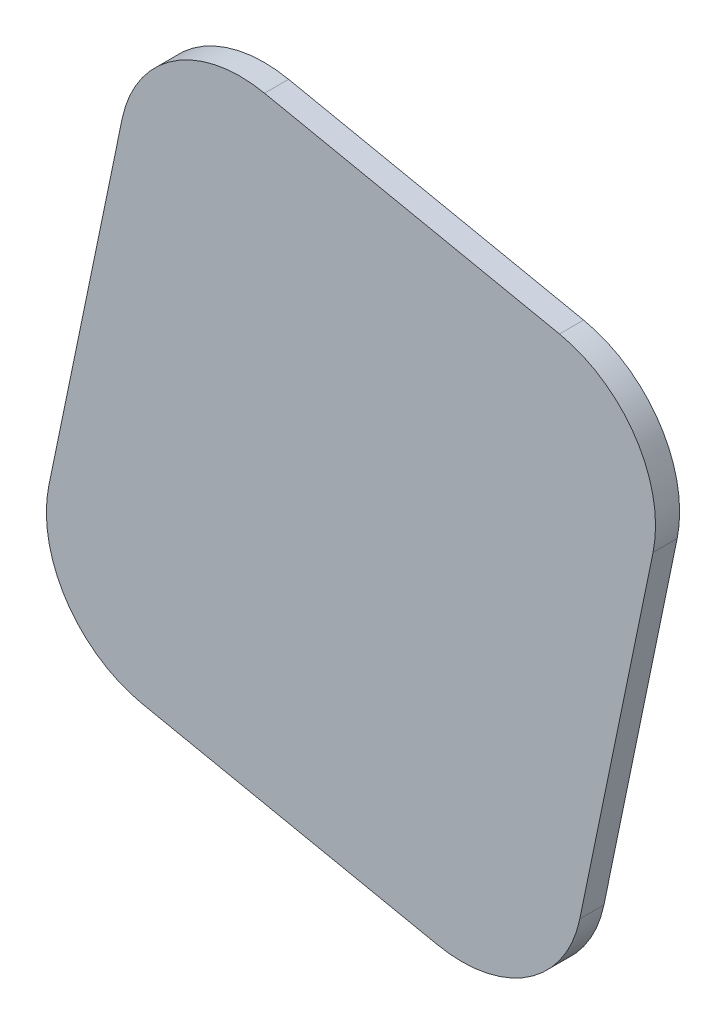
ISO-10303-21;
HEADER;
FILE_DESCRIPTION(('STEP AP214'),'2;1');
FILE_NAME('part.step','',(''),(''),'','','');
FILE_SCHEMA(('AUTOMOTIVE_DESIGN { 1 0 10303 214 1 1 1 1 }'));
ENDSEC;
DATA;
#1=APPLICATION_CONTEXT('core data for automotive mechanical design processes');
#2=APPLICATION_PROTOCOL_DEFINITION('international standard','automotive_design',2000,#1);
#3=PRODUCT_CONTEXT('',#1,'mechanical');
#4=PRODUCT('Part','Part','',(#3));
#5=PRODUCT_RELATED_PRODUCT_CATEGORY('part','',(#4));
#6=PRODUCT_DEFINITION_FORMATION('','',#4);
#7=PRODUCT_DEFINITION_CONTEXT('part definition',#1,'design');
#8=PRODUCT_DEFINITION('design','',#6,#7);
#9=PRODUCT_DEFINITION_SHAPE('','',#8);
#10=(LENGTH_UNIT() NAMED_UNIT(*) SI_UNIT(.MILLI.,.METRE.));
#11=(NAMED_UNIT(*) PLANE_ANGLE_UNIT() SI_UNIT($,.RADIAN.));
#12=(NAMED_UNIT(*) SI_UNIT($,.STERADIAN.) SOLID_ANGLE_UNIT());
#13=UNCERTAINTY_MEASURE_WITH_UNIT(LENGTH_MEASURE(1.E-05),#10,'distance_accuracy_value','');
#14=(GEOMETRIC_REPRESENTATION_CONTEXT(3) GLOBAL_UNCERTAINTY_ASSIGNED_CONTEXT((#13)) GLOBAL_UNIT_ASSIGNED_CONTEXT((#10,
#11,#12)) REPRESENTATION_CONTEXT('',''));
#15=CARTESIAN_POINT('',(0.,0.,0.));
#16=DIRECTION('',(0.,0.,1.));
#17=DIRECTION('',(1.,0.,0.));
#18=AXIS2_PLACEMENT_3D('',#15,#16,#17);
#19=CARTESIAN_POINT('',(-99.2092107762712,80.7636589088314,2.));
#20=DIRECTION('',(0.979260419507103,-0.202605604035952,0.));
#21=DIRECTION('',(0.202605604035952,0.979260419507103,0.));
#22=AXIS2_PLACEMENT_3D('',#19,#20,#21);
#23=PLANE('',#22);
#24=DIRECTION('',(-0.202605604035952,-0.979260419507103,0.));
#25=VECTOR('',#24,1.);
#26=CARTESIAN_POINT('',(-99.2092107762712,80.7636589088314,2.));
#27=LINE('',#26,#25);
#28=CARTESIAN_POINT('',(-101.235266816631,70.9710547137604,2.));
#29=VERTEX_POINT('',#28);
#30=CARTESIAN_POINT('',(-107.313434937709,41.5932421285473,2.));
#31=VERTEX_POINT('',#30);
#32=EDGE_CURVE('E118',#29,#31,#27,.T.);
#33=ORIENTED_EDGE('',*,*,#32,.F.);
#34=DIRECTION('',(0.,0.,-1.));
#35=VECTOR('',#34,1.);
#36=CARTESIAN_POINT('',(-101.235266816631,70.9710547137604,2.));
#37=LINE('',#36,#35);
#38=CARTESIAN_POINT('',(-101.235266816631,70.9710547137604,0.));
#39=VERTEX_POINT('',#38);
#40=EDGE_CURVE('E103',#29,#39,#37,.T.);
#41=ORIENTED_EDGE('',*,*,#40,.T.);
#42=DIRECTION('',(-0.202605604035952,-0.979260419507103,0.));
#43=VECTOR('',#42,1.);
#44=CARTESIAN_POINT('',(-99.2092107762712,80.7636589088314,0.));
#45=LINE('',#44,#43);
#46=CARTESIAN_POINT('',(-107.313434937709,41.5932421285473,0.));
#47=VERTEX_POINT('',#46);
#48=EDGE_CURVE('E115',#39,#47,#45,.T.);
#49=ORIENTED_EDGE('',*,*,#48,.T.);
#50=DIRECTION('',(0.,0.,-1.));
#51=VECTOR('',#50,1.);
#52=CARTESIAN_POINT('',(-107.313434937709,41.5932421285473,2.));
#53=LINE('',#52,#51);
#54=EDGE_CURVE('E120',#47,#31,#53,.F.);
#55=ORIENTED_EDGE('',*,*,#54,.T.);
#56=EDGE_LOOP('',(#33,#41,#49,#55));
#57=FACE_BOUND('',#56,.T.);
#58=ADVANCED_FACE('F33',(#57),#23,.F.);
#59=CARTESIAN_POINT('',(-109.339490978069,31.8006379334763,2.));
#60=DIRECTION('',(0.202605604035952,0.979260419507103,0.));
#61=DIRECTION('',(-0.979260419507103,0.202605604035952,0.));
#62=AXIS2_PLACEMENT_3D('',#59,#60,#61);
#63=PLANE('',#62);
#64=DIRECTION('',(0.979260419507103,-0.202605604035952,0.));
#65=VECTOR('',#64,1.);
#66=CARTESIAN_POINT('',(-109.339490978069,31.8006379334763,0.));
#67=LINE('',#66,#65);
#68=CARTESIAN_POINT('',(-99.5468867829978,29.7745818931168,0.));
#69=VERTEX_POINT('',#68);
#70=CARTESIAN_POINT('',(-75.0653762953203,24.709441792218,0.));
#71=VERTEX_POINT('',#70);
#72=EDGE_CURVE('E124',#69,#71,#67,.T.);
#73=ORIENTED_EDGE('',*,*,#72,.T.);
#74=DIRECTION('',(0.,0.,-1.));
#75=VECTOR('',#74,1.);
#76=CARTESIAN_POINT('',(-75.0653762953203,24.709441792218,2.));
#77=LINE('',#76,#75);
#78=CARTESIAN_POINT('',(-75.0653762953203,24.709441792218,2.));
#79=VERTEX_POINT('',#78);
#80=EDGE_CURVE('E11',#71,#79,#77,.F.);
#81=ORIENTED_EDGE('',*,*,#80,.T.);
#82=DIRECTION('',(0.979260419507103,-0.202605604035952,0.));
#83=VECTOR('',#82,1.);
#84=CARTESIAN_POINT('',(-109.339490978069,31.8006379334763,2.));
#85=LINE('',#84,#83);
#86=CARTESIAN_POINT('',(-99.5468867829978,29.7745818931168,2.));
#87=VERTEX_POINT('',#86);
#88=EDGE_CURVE('E160',#87,#79,#85,.T.);
#89=ORIENTED_EDGE('',*,*,#88,.F.);
#90=DIRECTION('',(0.,0.,-1.));
#91=VECTOR('',#90,1.);
#92=CARTESIAN_POINT('',(-99.5468867829978,29.7745818931168,2.));
#93=LINE('',#92,#91);
#94=EDGE_CURVE('E41',#87,#69,#93,.T.);
#95=ORIENTED_EDGE('',*,*,#94,.T.);
#96=EDGE_LOOP('',(#73,#81,#89,#95));
#97=FACE_BOUND('',#96,.T.);
#98=ADVANCED_FACE('F158',(#97),#63,.F.);
#99=CARTESIAN_POINT('',(-55.1424918984516,71.6464067272136,2.));
#100=DIRECTION('',(-0.979260419507103,0.202605604035952,0.));
#101=DIRECTION('',(-0.202605604035952,-0.979260419507103,0.));
#102=AXIS2_PLACEMENT_3D('',#99,#100,#101);
#103=PLANE('',#102);
#104=DIRECTION('',(0.202605604035952,0.979260419507103,0.));
#105=VECTOR('',#104,1.);
#106=CARTESIAN_POINT('',(-55.1424918984516,71.6464067272136,0.));
#107=LINE('',#106,#105);
#108=CARTESIAN_POINT('',(-63.2467160598897,32.4759899469295,0.));
#109=VERTEX_POINT('',#108);
#110=CARTESIAN_POINT('',(-57.1685479388111,61.8538025321426,0.));
#111=VERTEX_POINT('',#110);
#112=EDGE_CURVE('E127',#109,#111,#107,.T.);
#113=ORIENTED_EDGE('',*,*,#112,.T.);
#114=DIRECTION('',(0.,0.,-1.));
#115=VECTOR('',#114,1.);
#116=CARTESIAN_POINT('',(-57.1685479388111,61.8538025321426,2.));
#117=LINE('',#116,#115);
#118=CARTESIAN_POINT('',(-57.1685479388111,61.8538025321426,2.));
#119=VERTEX_POINT('',#118);
#120=EDGE_CURVE('E48',#111,#119,#117,.F.);
#121=ORIENTED_EDGE('',*,*,#120,.T.);
#122=DIRECTION('',(0.202605604035952,0.979260419507103,0.));
#123=VECTOR('',#122,1.);
#124=CARTESIAN_POINT('',(-55.1424918984516,71.6464067272136,2.));
#125=LINE('',#124,#123);
#126=CARTESIAN_POINT('',(-63.2467160598897,32.4759899469295,2.));
#127=VERTEX_POINT('',#126);
#128=EDGE_CURVE('E168',#127,#119,#125,.T.);
#129=ORIENTED_EDGE('',*,*,#128,.F.);
#130=DIRECTION('',(0.,0.,-1.));
#131=VECTOR('',#130,1.);
#132=CARTESIAN_POINT('',(-63.2467160598897,32.4759899469295,2.));
#133=LINE('',#132,#131);
#134=EDGE_CURVE('E151',#127,#109,#133,.T.);
#135=ORIENTED_EDGE('',*,*,#134,.T.);
#136=EDGE_LOOP('',(#113,#121,#129,#135));
#137=FACE_BOUND('',#136,.T.);
#138=ADVANCED_FACE('F167',(#137),#103,.F.);
#139=CARTESIAN_POINT('',(-99.2092107762712,80.7636589088314,2.));
#140=DIRECTION('',(-0.202605604035952,-0.979260419507103,0.));
#141=DIRECTION('',(0.979260419507103,-0.202605604035952,0.));
#142=AXIS2_PLACEMENT_3D('',#139,#140,#141);
#143=PLANE('',#142);
#144=DIRECTION('',(-0.979260419507103,0.202605604035952,0.));
#145=VECTOR('',#144,1.);
#146=CARTESIAN_POINT('',(-99.2092107762712,80.7636589088314,0.));
#147=LINE('',#146,#145);
#148=CARTESIAN_POINT('',(-64.9350960935227,73.6724627675731,0.));
#149=VERTEX_POINT('',#148);
#150=CARTESIAN_POINT('',(-89.4166065812002,78.7376028684719,0.));
#151=VERTEX_POINT('',#150);
#152=EDGE_CURVE('E134',#149,#151,#147,.T.);
#153=ORIENTED_EDGE('',*,*,#152,.T.);
#154=DIRECTION('',(0.,0.,-1.));
#155=VECTOR('',#154,1.);
#156=CARTESIAN_POINT('',(-89.4166065812002,78.7376028684719,2.));
#157=LINE('',#156,#155);
#158=CARTESIAN_POINT('',(-89.4166065812002,78.7376028684719,2.));
#159=VERTEX_POINT('',#158);
#160=EDGE_CURVE('E104',#151,#159,#157,.F.);
#161=ORIENTED_EDGE('',*,*,#160,.T.);
#162=DIRECTION('',(-0.979260419507103,0.202605604035952,0.));
#163=VECTOR('',#162,1.);
#164=CARTESIAN_POINT('',(-99.2092107762712,80.7636589088314,2.));
#165=LINE('',#164,#163);
#166=CARTESIAN_POINT('',(-64.9350960935227,73.6724627675731,2.));
#167=VERTEX_POINT('',#166);
#168=EDGE_CURVE('E130',#167,#159,#165,.T.);
#169=ORIENTED_EDGE('',*,*,#168,.F.);
#170=DIRECTION('',(0.,0.,-1.));
#171=VECTOR('',#170,1.);
#172=CARTESIAN_POINT('',(-64.9350960935226,73.6724627675731,2.));
#173=LINE('',#172,#171);
#174=EDGE_CURVE('E109',#167,#149,#173,.T.);
#175=ORIENTED_EDGE('',*,*,#174,.T.);
#176=EDGE_LOOP('',(#153,#161,#169,#175));
#177=FACE_BOUND('',#176,.T.);
#178=ADVANCED_FACE('F196',(#177),#143,.F.);
#179=CARTESIAN_POINT('',(0.,0.,2.));
#180=DIRECTION('',(0.,0.,1.));
#181=DIRECTION('',(1.,0.,0.));
#182=AXIS2_PLACEMENT_3D('',#179,#180,#181);
#183=PLANE('',#182);
#184=ORIENTED_EDGE('',*,*,#168,.T.);
#185=CARTESIAN_POINT('',(-91.4426626215597,68.9449986734009,2.));
#186=DIRECTION('',(0.,0.,1.));
#187=DIRECTION('',(1.,0.,0.));
#188=AXIS2_PLACEMENT_3D('',#185,#186,#187);
#189=CIRCLE('',#188,10.);
#190=EDGE_CURVE('E149',#159,#29,#189,.T.);
#191=ORIENTED_EDGE('',*,*,#190,.T.);
#192=ORIENTED_EDGE('',*,*,#32,.T.);
#193=CARTESIAN_POINT('',(-97.5208307426383,39.5671860881878,2.));
#194=DIRECTION('',(0.,0.,1.));
#195=DIRECTION('',(1.,0.,0.));
#196=AXIS2_PLACEMENT_3D('',#193,#194,#195);
#197=CIRCLE('',#196,10.);
#198=EDGE_CURVE('E144',#31,#87,#197,.T.);
#199=ORIENTED_EDGE('',*,*,#198,.T.);
#200=ORIENTED_EDGE('',*,*,#88,.T.);
#201=CARTESIAN_POINT('',(-73.0393202549607,34.502045987289,2.));
#202=DIRECTION('',(0.,0.,1.));
#203=DIRECTION('',(1.,0.,0.));
#204=AXIS2_PLACEMENT_3D('',#201,#202,#203);
#205=CIRCLE('',#204,10.);
#206=EDGE_CURVE('E55',#79,#127,#205,.T.);
#207=ORIENTED_EDGE('',*,*,#206,.T.);
#208=ORIENTED_EDGE('',*,*,#128,.T.);
#209=CARTESIAN_POINT('',(-66.9611521338822,63.8798585725021,2.));
#210=DIRECTION('',(0.,0.,1.));
#211=DIRECTION('',(1.,0.,0.));
#212=AXIS2_PLACEMENT_3D('',#209,#210,#211);
#213=CIRCLE('',#212,10.);
#214=EDGE_CURVE('E147',#119,#167,#213,.T.);
#215=ORIENTED_EDGE('',*,*,#214,.T.);
#216=EDGE_LOOP('',(#184,#191,#192,#199,#200,#207,#208,#215));
#217=FACE_BOUND('',#216,.T.);
#218=ADVANCED_FACE('F173',(#217),#183,.T.);
#219=CARTESIAN_POINT('',(0.,0.,0.));
#220=DIRECTION('',(0.,0.,1.));
#221=DIRECTION('',(1.,0.,0.));
#222=AXIS2_PLACEMENT_3D('',#219,#220,#221);
#223=PLANE('',#222);
#224=ORIENTED_EDGE('',*,*,#48,.F.);
#225=CARTESIAN_POINT('',(-91.4426626215597,68.9449986734009,0.));
#226=DIRECTION('',(0.,0.,1.));
#227=DIRECTION('',(1.,0.,0.));
#228=AXIS2_PLACEMENT_3D('',#225,#226,#227);
#229=CIRCLE('',#228,10.);
#230=EDGE_CURVE('E99',#39,#151,#229,.F.);
#231=ORIENTED_EDGE('',*,*,#230,.T.);
#232=ORIENTED_EDGE('',*,*,#152,.F.);
#233=CARTESIAN_POINT('',(-66.9611521338822,63.8798585725021,0.));
#234=DIRECTION('',(0.,0.,1.));
#235=DIRECTION('',(1.,0.,0.));
#236=AXIS2_PLACEMENT_3D('',#233,#234,#235);
#237=CIRCLE('',#236,10.);
#238=EDGE_CURVE('E110',#149,#111,#237,.F.);
#239=ORIENTED_EDGE('',*,*,#238,.T.);
#240=ORIENTED_EDGE('',*,*,#112,.F.);
#241=CARTESIAN_POINT('',(-73.0393202549607,34.502045987289,0.));
#242=DIRECTION('',(0.,0.,1.));
#243=DIRECTION('',(1.,0.,0.));
#244=AXIS2_PLACEMENT_3D('',#241,#242,#243);
#245=CIRCLE('',#244,10.);
#246=EDGE_CURVE('E138',#109,#71,#245,.F.);
#247=ORIENTED_EDGE('',*,*,#246,.T.);
#248=ORIENTED_EDGE('',*,*,#72,.F.);
#249=CARTESIAN_POINT('',(-97.5208307426383,39.5671860881878,0.));
#250=DIRECTION('',(0.,0.,1.));
#251=DIRECTION('',(1.,0.,0.));
#252=AXIS2_PLACEMENT_3D('',#249,#250,#251);
#253=CIRCLE('',#252,10.);
#254=EDGE_CURVE('E119',#69,#47,#253,.F.);
#255=ORIENTED_EDGE('',*,*,#254,.T.);
#256=EDGE_LOOP('',(#224,#231,#232,#239,#240,#247,#248,#255));
#257=FACE_BOUND('',#256,.T.);
#258=ADVANCED_FACE('F122',(#257),#223,.F.);
#259=CARTESIAN_POINT('',(-91.4426626215597,68.9449986734009,2.));
#260=DIRECTION('',(0.,0.,-1.));
#261=DIRECTION('',(-1.,0.,0.));
#262=AXIS2_PLACEMENT_3D('',#259,#260,#261);
#263=CYLINDRICAL_SURFACE('',#262,10.);
#264=ORIENTED_EDGE('',*,*,#190,.F.);
#265=ORIENTED_EDGE('',*,*,#160,.F.);
#266=ORIENTED_EDGE('',*,*,#230,.F.);
#267=ORIENTED_EDGE('',*,*,#40,.F.);
#268=EDGE_LOOP('',(#264,#265,#266,#267));
#269=FACE_BOUND('',#268,.T.);
#270=ADVANCED_FACE('F102',(#269),#263,.T.);
#271=CARTESIAN_POINT('',(-66.9611521338822,63.8798585725021,2.));
#272=DIRECTION('',(0.,0.,-1.));
#273=DIRECTION('',(-1.,0.,0.));
#274=AXIS2_PLACEMENT_3D('',#271,#272,#273);
#275=CYLINDRICAL_SURFACE('',#274,10.);
#276=ORIENTED_EDGE('',*,*,#214,.F.);
#277=ORIENTED_EDGE('',*,*,#120,.F.);
#278=ORIENTED_EDGE('',*,*,#238,.F.);
#279=ORIENTED_EDGE('',*,*,#174,.F.);
#280=EDGE_LOOP('',(#276,#277,#278,#279));
#281=FACE_BOUND('',#280,.T.);
#282=ADVANCED_FACE('F178',(#281),#275,.T.);
#283=CARTESIAN_POINT('',(-73.0393202549607,34.502045987289,2.));
#284=DIRECTION('',(0.,0.,-1.));
#285=DIRECTION('',(-1.,0.,0.));
#286=AXIS2_PLACEMENT_3D('',#283,#284,#285);
#287=CYLINDRICAL_SURFACE('',#286,10.);
#288=ORIENTED_EDGE('',*,*,#206,.F.);
#289=ORIENTED_EDGE('',*,*,#80,.F.);
#290=ORIENTED_EDGE('',*,*,#246,.F.);
#291=ORIENTED_EDGE('',*,*,#134,.F.);
#292=EDGE_LOOP('',(#288,#289,#290,#291));
#293=FACE_BOUND('',#292,.T.);
#294=ADVANCED_FACE('F166',(#293),#287,.T.);
#295=CARTESIAN_POINT('',(-97.5208307426383,39.5671860881878,2.));
#296=DIRECTION('',(0.,0.,-1.));
#297=DIRECTION('',(-1.,0.,0.));
#298=AXIS2_PLACEMENT_3D('',#295,#296,#297);
#299=CYLINDRICAL_SURFACE('',#298,10.);
#300=ORIENTED_EDGE('',*,*,#198,.F.);
#301=ORIENTED_EDGE('',*,*,#54,.F.);
#302=ORIENTED_EDGE('',*,*,#254,.F.);
#303=ORIENTED_EDGE('',*,*,#94,.F.);
#304=EDGE_LOOP('',(#300,#301,#302,#303));
#305=FACE_BOUND('',#304,.T.);
#306=ADVANCED_FACE('F35',(#305),#299,.T.);
#307=CLOSED_SHELL('',(#58,#98,#138,#178,#218,#258,#270,#282,#294,#306));
#308=MANIFOLD_SOLID_BREP('B2',#307);
#309=ADVANCED_BREP_SHAPE_REPRESENTATION('',(#18,#308),#14);
#310=SHAPE_DEFINITION_REPRESENTATION(#9,#309);
ENDSEC;
END-ISO-10303-21;
